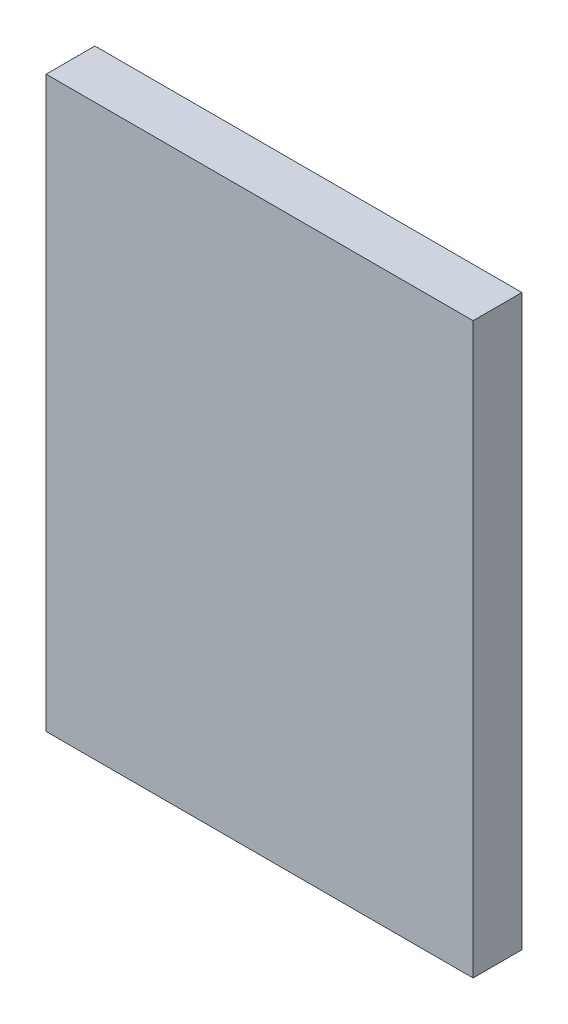
ISO-10303-21;
HEADER;
FILE_DESCRIPTION(('STEP AP214'),'2;1');
FILE_NAME('part.step','',(''),(''),'','','');
FILE_SCHEMA(('AUTOMOTIVE_DESIGN { 1 0 10303 214 1 1 1 1 }'));
ENDSEC;
DATA;
#1=APPLICATION_CONTEXT('core data for automotive mechanical design processes');
#2=APPLICATION_PROTOCOL_DEFINITION('international standard','automotive_design',2000,#1);
#3=PRODUCT_CONTEXT('',#1,'mechanical');
#4=PRODUCT('Part','Part','',(#3));
#5=PRODUCT_RELATED_PRODUCT_CATEGORY('part','',(#4));
#6=PRODUCT_DEFINITION_FORMATION('','',#4);
#7=PRODUCT_DEFINITION_CONTEXT('part definition',#1,'design');
#8=PRODUCT_DEFINITION('design','',#6,#7);
#9=PRODUCT_DEFINITION_SHAPE('','',#8);
#10=(LENGTH_UNIT() NAMED_UNIT(*) SI_UNIT(.MILLI.,.METRE.));
#11=(NAMED_UNIT(*) PLANE_ANGLE_UNIT() SI_UNIT($,.RADIAN.));
#12=(NAMED_UNIT(*) SI_UNIT($,.STERADIAN.) SOLID_ANGLE_UNIT());
#13=UNCERTAINTY_MEASURE_WITH_UNIT(LENGTH_MEASURE(1.E-05),#10,'distance_accuracy_value','');
#14=(GEOMETRIC_REPRESENTATION_CONTEXT(3) GLOBAL_UNCERTAINTY_ASSIGNED_CONTEXT((#13)) GLOBAL_UNIT_ASSIGNED_CONTEXT((#10,
#11,#12)) REPRESENTATION_CONTEXT('',''));
#15=CARTESIAN_POINT('',(0.,0.,0.));
#16=DIRECTION('',(0.,0.,1.));
#17=DIRECTION('',(1.,0.,0.));
#18=AXIS2_PLACEMENT_3D('',#15,#16,#17);
#19=CARTESIAN_POINT('',(6.278,8.801,0.76487));
#20=DIRECTION('',(0.,0.,-1.));
#21=DIRECTION('',(-1.,0.,0.));
#22=AXIS2_PLACEMENT_3D('',#19,#20,#21);
#23=PLANE('',#22);
#24=DIRECTION('',(1.,0.,0.));
#25=VECTOR('',#24,1.);
#26=CARTESIAN_POINT('',(6.128,9.001,0.76487));
#27=LINE('',#26,#25);
#28=CARTESIAN_POINT('',(6.128,9.001,0.76487));
#29=VERTEX_POINT('',#28);
#30=CARTESIAN_POINT('',(6.428,9.001,0.76487));
#31=VERTEX_POINT('',#30);
#32=EDGE_CURVE('E55',#29,#31,#27,.T.);
#33=ORIENTED_EDGE('',*,*,#32,.T.);
#34=DIRECTION('',(0.,1.,0.));
#35=VECTOR('',#34,1.);
#36=CARTESIAN_POINT('',(6.428,9.001,0.76487));
#37=LINE('',#36,#35);
#38=CARTESIAN_POINT('',(6.428,8.601,0.76487));
#39=VERTEX_POINT('',#38);
#40=EDGE_CURVE('E57',#31,#39,#37,.F.);
#41=ORIENTED_EDGE('',*,*,#40,.T.);
#42=DIRECTION('',(1.,0.,0.));
#43=VECTOR('',#42,1.);
#44=CARTESIAN_POINT('',(6.428,8.601,0.76487));
#45=LINE('',#44,#43);
#46=CARTESIAN_POINT('',(6.128,8.601,0.76487));
#47=VERTEX_POINT('',#46);
#48=EDGE_CURVE('E20',#39,#47,#45,.F.);
#49=ORIENTED_EDGE('',*,*,#48,.T.);
#50=DIRECTION('',(0.,1.,0.));
#51=VECTOR('',#50,1.);
#52=CARTESIAN_POINT('',(6.128,8.601,0.76487));
#53=LINE('',#52,#51);
#54=EDGE_CURVE('E80',#47,#29,#53,.T.);
#55=ORIENTED_EDGE('',*,*,#54,.T.);
#56=EDGE_LOOP('',(#33,#41,#49,#55));
#57=FACE_BOUND('',#56,.T.);
#58=ADVANCED_FACE('F17',(#57),#23,.T.);
#59=CARTESIAN_POINT('',(6.428,8.601,0.76487));
#60=DIRECTION('',(0.,1.,0.));
#61=DIRECTION('',(0.,0.,1.));
#62=AXIS2_PLACEMENT_3D('',#59,#60,#61);
#63=PLANE('',#62);
#64=DIRECTION('',(0.,0.,1.));
#65=VECTOR('',#64,1.);
#66=CARTESIAN_POINT('',(6.128,8.601,0.76487));
#67=LINE('',#66,#65);
#68=CARTESIAN_POINT('',(6.128,8.601,0.79916));
#69=VERTEX_POINT('',#68);
#70=EDGE_CURVE('E68',#69,#47,#67,.F.);
#71=ORIENTED_EDGE('',*,*,#70,.T.);
#72=ORIENTED_EDGE('',*,*,#48,.F.);
#73=DIRECTION('',(0.,0.,1.));
#74=VECTOR('',#73,1.);
#75=CARTESIAN_POINT('',(6.428,8.601,0.76487));
#76=LINE('',#75,#74);
#77=CARTESIAN_POINT('',(6.428,8.601,0.79916));
#78=VERTEX_POINT('',#77);
#79=EDGE_CURVE('E63',#39,#78,#76,.T.);
#80=ORIENTED_EDGE('',*,*,#79,.T.);
#81=DIRECTION('',(1.,0.,0.));
#82=VECTOR('',#81,1.);
#83=CARTESIAN_POINT('',(6.278,8.601,0.79916));
#84=LINE('',#83,#82);
#85=EDGE_CURVE('E83',#69,#78,#84,.T.);
#86=ORIENTED_EDGE('',*,*,#85,.F.);
#87=EDGE_LOOP('',(#71,#72,#80,#86));
#88=FACE_BOUND('',#87,.T.);
#89=ADVANCED_FACE('F65',(#88),#63,.F.);
#90=CARTESIAN_POINT('',(6.428,9.001,0.76487));
#91=DIRECTION('',(-1.,0.,0.));
#92=DIRECTION('',(0.,0.,1.));
#93=AXIS2_PLACEMENT_3D('',#90,#91,#92);
#94=PLANE('',#93);
#95=ORIENTED_EDGE('',*,*,#79,.F.);
#96=ORIENTED_EDGE('',*,*,#40,.F.);
#97=DIRECTION('',(0.,0.,-1.));
#98=VECTOR('',#97,1.);
#99=CARTESIAN_POINT('',(6.428,9.001,0.76487));
#100=LINE('',#99,#98);
#101=CARTESIAN_POINT('',(6.428,9.001,0.79916));
#102=VERTEX_POINT('',#101);
#103=EDGE_CURVE('E75',#31,#102,#100,.F.);
#104=ORIENTED_EDGE('',*,*,#103,.T.);
#105=DIRECTION('',(0.,-1.,0.));
#106=VECTOR('',#105,1.);
#107=CARTESIAN_POINT('',(6.428,8.801,0.79916));
#108=LINE('',#107,#106);
#109=EDGE_CURVE('E72',#78,#102,#108,.F.);
#110=ORIENTED_EDGE('',*,*,#109,.F.);
#111=EDGE_LOOP('',(#95,#96,#104,#110));
#112=FACE_BOUND('',#111,.T.);
#113=ADVANCED_FACE('F70',(#112),#94,.F.);
#114=CARTESIAN_POINT('',(6.128,9.001,0.76487));
#115=DIRECTION('',(0.,-1.,0.));
#116=DIRECTION('',(0.,0.,-1.));
#117=AXIS2_PLACEMENT_3D('',#114,#115,#116);
#118=PLANE('',#117);
#119=ORIENTED_EDGE('',*,*,#103,.F.);
#120=ORIENTED_EDGE('',*,*,#32,.F.);
#121=DIRECTION('',(0.,0.,1.));
#122=VECTOR('',#121,1.);
#123=CARTESIAN_POINT('',(6.128,9.001,0.76487));
#124=LINE('',#123,#122);
#125=CARTESIAN_POINT('',(6.128,9.001,0.79916));
#126=VERTEX_POINT('',#125);
#127=EDGE_CURVE('E35',#29,#126,#124,.T.);
#128=ORIENTED_EDGE('',*,*,#127,.T.);
#129=DIRECTION('',(1.,0.,0.));
#130=VECTOR('',#129,1.);
#131=CARTESIAN_POINT('',(6.278,9.001,0.79916));
#132=LINE('',#131,#130);
#133=EDGE_CURVE('E26',#102,#126,#132,.F.);
#134=ORIENTED_EDGE('',*,*,#133,.F.);
#135=EDGE_LOOP('',(#119,#120,#128,#134));
#136=FACE_BOUND('',#135,.T.);
#137=ADVANCED_FACE('F89',(#136),#118,.F.);
#138=CARTESIAN_POINT('',(6.128,8.601,0.76487));
#139=DIRECTION('',(1.,0.,0.));
#140=DIRECTION('',(0.,1.,0.));
#141=AXIS2_PLACEMENT_3D('',#138,#139,#140);
#142=PLANE('',#141);
#143=ORIENTED_EDGE('',*,*,#127,.F.);
#144=ORIENTED_EDGE('',*,*,#54,.F.);
#145=ORIENTED_EDGE('',*,*,#70,.F.);
#146=DIRECTION('',(0.,-1.,0.));
#147=VECTOR('',#146,1.);
#148=CARTESIAN_POINT('',(6.128,8.801,0.79916));
#149=LINE('',#148,#147);
#150=EDGE_CURVE('E11',#126,#69,#149,.T.);
#151=ORIENTED_EDGE('',*,*,#150,.F.);
#152=EDGE_LOOP('',(#143,#144,#145,#151));
#153=FACE_BOUND('',#152,.T.);
#154=ADVANCED_FACE('F91',(#153),#142,.F.);
#155=CARTESIAN_POINT('',(6.278,8.801,0.79916));
#156=DIRECTION('',(0.,0.,1.));
#157=DIRECTION('',(0.,-1.,0.));
#158=AXIS2_PLACEMENT_3D('',#155,#156,#157);
#159=PLANE('',#158);
#160=ORIENTED_EDGE('',*,*,#133,.T.);
#161=ORIENTED_EDGE('',*,*,#150,.T.);
#162=ORIENTED_EDGE('',*,*,#85,.T.);
#163=ORIENTED_EDGE('',*,*,#109,.T.);
#164=EDGE_LOOP('',(#160,#161,#162,#163));
#165=FACE_BOUND('',#164,.T.);
#166=ADVANCED_FACE('F88',(#165),#159,.T.);
#167=CLOSED_SHELL('',(#58,#89,#113,#137,#154,#166));
#168=MANIFOLD_SOLID_BREP('B1',#167);
#169=ADVANCED_BREP_SHAPE_REPRESENTATION('',(#18,#168),#14);
#170=SHAPE_DEFINITION_REPRESENTATION(#9,#169);
ENDSEC;
END-ISO-10303-21;
